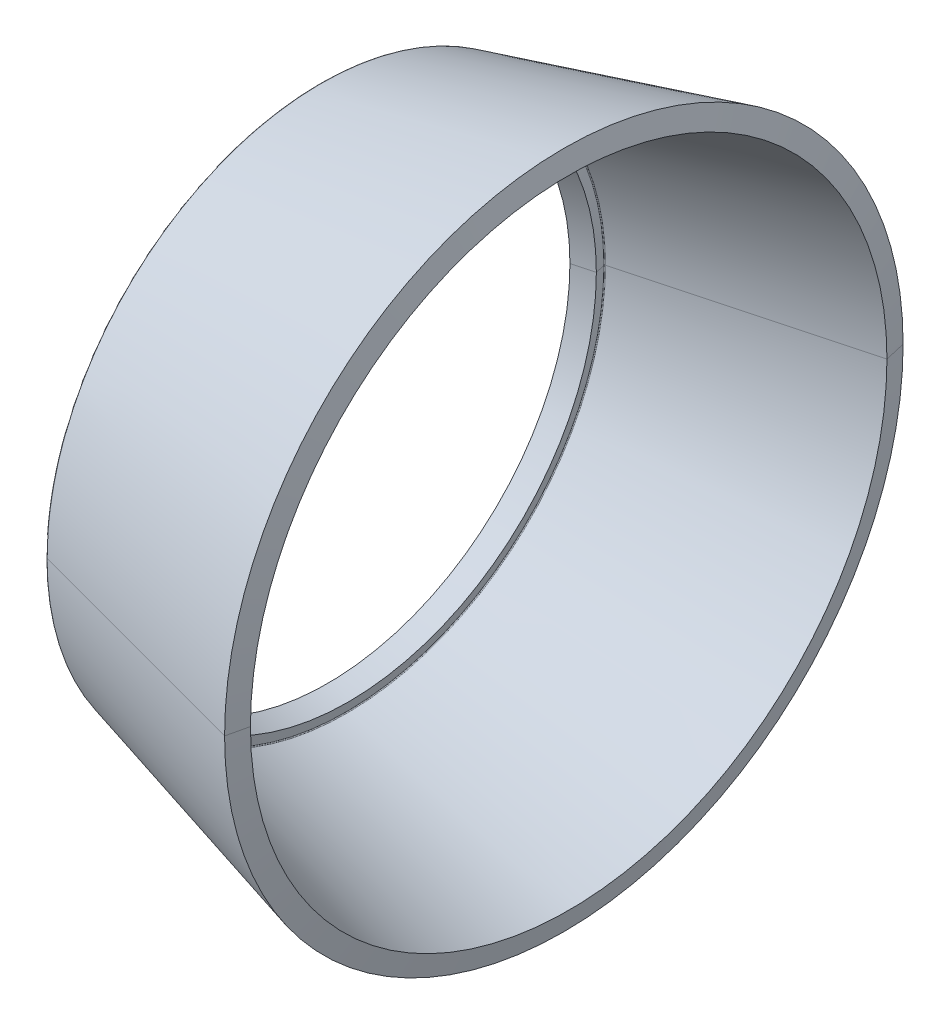
ISO-10303-21;
HEADER;
FILE_DESCRIPTION(('STEP AP214'),'2;1');
FILE_NAME('part.step','',(''),(''),'','','');
FILE_SCHEMA(('AUTOMOTIVE_DESIGN { 1 0 10303 214 1 1 1 1 }'));
ENDSEC;
DATA;
#1=APPLICATION_CONTEXT('core data for automotive mechanical design processes');
#2=APPLICATION_PROTOCOL_DEFINITION('international standard','automotive_design',2000,#1);
#3=PRODUCT_CONTEXT('',#1,'mechanical');
#4=PRODUCT('Part','Part','',(#3));
#5=PRODUCT_RELATED_PRODUCT_CATEGORY('part','',(#4));
#6=PRODUCT_DEFINITION_FORMATION('','',#4);
#7=PRODUCT_DEFINITION_CONTEXT('part definition',#1,'design');
#8=PRODUCT_DEFINITION('design','',#6,#7);
#9=PRODUCT_DEFINITION_SHAPE('','',#8);
#10=(LENGTH_UNIT() NAMED_UNIT(*) SI_UNIT(.MILLI.,.METRE.));
#11=(NAMED_UNIT(*) PLANE_ANGLE_UNIT() SI_UNIT($,.RADIAN.));
#12=(NAMED_UNIT(*) SI_UNIT($,.STERADIAN.) SOLID_ANGLE_UNIT());
#13=UNCERTAINTY_MEASURE_WITH_UNIT(LENGTH_MEASURE(1.E-05),#10,'distance_accuracy_value','');
#14=(GEOMETRIC_REPRESENTATION_CONTEXT(3) GLOBAL_UNCERTAINTY_ASSIGNED_CONTEXT((#13)) GLOBAL_UNIT_ASSIGNED_CONTEXT((#10,
#11,#12)) REPRESENTATION_CONTEXT('',''));
#15=CARTESIAN_POINT('',(0.,0.,0.));
#16=DIRECTION('',(0.,0.,1.));
#17=DIRECTION('',(1.,0.,0.));
#18=AXIS2_PLACEMENT_3D('',#15,#16,#17);
#19=CARTESIAN_POINT('',(10.675889688428,0.,0.));
#20=DIRECTION('',(1.,0.,0.));
#21=DIRECTION('',(0.,1.,0.));
#22=AXIS2_PLACEMENT_3D('',#19,#20,#21);
#23=CONICAL_SURFACE('',#22,15.747207635831,0.261904107554317);
#24=DIRECTION('',(0.965898717525801,0.,0.25892019519924));
#25=VECTOR('',#24,1.);
#26=CARTESIAN_POINT('',(-0.57609560086553,0.,12.730984325228));
#27=LINE('',#26,#25);
#28=CARTESIAN_POINT('',(-0.57609560086553,0.,12.730984325228));
#29=VERTEX_POINT('',#28);
#30=CARTESIAN_POINT('',(10.675889688428,0.,15.747207635831));
#31=VERTEX_POINT('',#30);
#32=EDGE_CURVE('E11',#29,#31,#27,.T.);
#33=ORIENTED_EDGE('',*,*,#32,.F.);
#34=CARTESIAN_POINT('',(-0.57609560086553,0.,0.));
#35=DIRECTION('',(1.,0.,0.));
#36=DIRECTION('',(0.,0.,-1.));
#37=AXIS2_PLACEMENT_3D('',#34,#35,#36);
#38=CIRCLE('',#37,12.730984325228);
#39=CARTESIAN_POINT('',(-0.57609560086553,-12.1078856013595,-3.93409051161652));
#40=VERTEX_POINT('',#39);
#41=EDGE_CURVE('E25',#29,#40,#38,.T.);
#42=ORIENTED_EDGE('',*,*,#41,.T.);
#43=CARTESIAN_POINT('',(-0.57609560086553,0.,0.));
#44=DIRECTION('',(1.,0.,0.));
#45=DIRECTION('',(0.,0.,-1.));
#46=AXIS2_PLACEMENT_3D('',#43,#44,#45);
#47=CIRCLE('',#46,12.730984325228);
#48=CARTESIAN_POINT('',(-0.57609560086553,0.,-12.730984325228));
#49=VERTEX_POINT('',#48);
#50=EDGE_CURVE('E385',#40,#49,#47,.T.);
#51=ORIENTED_EDGE('',*,*,#50,.T.);
#52=DIRECTION('',(0.965898717525801,0.,-0.25892019519924));
#53=VECTOR('',#52,1.);
#54=CARTESIAN_POINT('',(-0.57609560086553,0.,-12.730984325228));
#55=LINE('',#54,#53);
#56=CARTESIAN_POINT('',(10.675889688428,0.,-15.747207635831));
#57=VERTEX_POINT('',#56);
#58=EDGE_CURVE('E125',#49,#57,#55,.T.);
#59=ORIENTED_EDGE('',*,*,#58,.T.);
#60=CARTESIAN_POINT('',(10.675889688428,0.,0.));
#61=DIRECTION('',(1.,0.,0.));
#62=DIRECTION('',(0.,0.,-1.));
#63=AXIS2_PLACEMENT_3D('',#60,#61,#62);
#64=CIRCLE('',#63,15.747207635831);
#65=EDGE_CURVE('E377',#31,#57,#64,.T.);
#66=ORIENTED_EDGE('',*,*,#65,.F.);
#67=EDGE_LOOP('',(#33,#42,#51,#59,#66));
#68=FACE_BOUND('',#67,.T.);
#69=ADVANCED_FACE('F17',(#68),#23,.T.);
#70=CARTESIAN_POINT('',(10.900978684766,0.,0.));
#71=DIRECTION('',(-1.,0.,0.));
#72=DIRECTION('',(0.,1.,0.));
#73=AXIS2_PLACEMENT_3D('',#70,#71,#72);
#74=CONICAL_SURFACE('',#73,14.772240078628,1.34390352403521);
#75=DIRECTION('',(-0.224951054344273,0.,-0.974370064785141));
#76=VECTOR('',#75,1.);
#77=CARTESIAN_POINT('',(10.900978684766,0.,-14.772240078628));
#78=LINE('',#77,#76);
#79=CARTESIAN_POINT('',(10.900978684766,0.,-14.772240078628));
#80=VERTEX_POINT('',#79);
#81=EDGE_CURVE('E372',#80,#57,#78,.T.);
#82=ORIENTED_EDGE('',*,*,#81,.F.);
#83=CARTESIAN_POINT('',(10.900978684766,0.,0.));
#84=DIRECTION('',(1.,0.,0.));
#85=DIRECTION('',(0.,0.,-1.));
#86=AXIS2_PLACEMENT_3D('',#83,#84,#85);
#87=CIRCLE('',#86,14.772240078628);
#88=CARTESIAN_POINT('',(10.900978684766,0.,14.772240078628));
#89=VERTEX_POINT('',#88);
#90=EDGE_CURVE('E367',#89,#80,#87,.T.);
#91=ORIENTED_EDGE('',*,*,#90,.F.);
#92=DIRECTION('',(-0.224951054344273,0.,0.974370064785141));
#93=VECTOR('',#92,1.);
#94=CARTESIAN_POINT('',(10.900978684766,0.,14.772240078628));
#95=LINE('',#94,#93);
#96=EDGE_CURVE('E362',#89,#31,#95,.T.);
#97=ORIENTED_EDGE('',*,*,#96,.T.);
#98=ORIENTED_EDGE('',*,*,#65,.T.);
#99=EDGE_LOOP('',(#82,#91,#97,#98));
#100=FACE_BOUND('',#99,.T.);
#101=ADVANCED_FACE('F426',(#100),#74,.T.);
#102=CARTESIAN_POINT('',(10.900978684766,0.,0.));
#103=DIRECTION('',(-1.,0.,0.));
#104=DIRECTION('',(0.,-1.,0.));
#105=AXIS2_PLACEMENT_3D('',#102,#103,#104);
#106=CONICAL_SURFACE('',#105,14.772240078628,1.34390352403521);
#107=ORIENTED_EDGE('',*,*,#81,.T.);
#108=CARTESIAN_POINT('',(10.675889688428,0.,0.));
#109=DIRECTION('',(1.,0.,0.));
#110=DIRECTION('',(0.,0.,-1.));
#111=AXIS2_PLACEMENT_3D('',#108,#109,#110);
#112=CIRCLE('',#111,15.747207635831);
#113=EDGE_CURVE('E357',#57,#31,#112,.T.);
#114=ORIENTED_EDGE('',*,*,#113,.T.);
#115=ORIENTED_EDGE('',*,*,#96,.F.);
#116=CARTESIAN_POINT('',(10.900978684766,0.,0.));
#117=DIRECTION('',(1.,0.,0.));
#118=DIRECTION('',(0.,0.,-1.));
#119=AXIS2_PLACEMENT_3D('',#116,#117,#118);
#120=CIRCLE('',#119,14.772240078628);
#121=EDGE_CURVE('E352',#80,#89,#120,.T.);
#122=ORIENTED_EDGE('',*,*,#121,.F.);
#123=EDGE_LOOP('',(#107,#114,#115,#122));
#124=FACE_BOUND('',#123,.T.);
#125=ADVANCED_FACE('F430',(#124),#106,.T.);
#126=CARTESIAN_POINT('',(0.596831214381699,0.,0.));
#127=DIRECTION('',(1.,0.,0.));
#128=DIRECTION('',(0.,-1.,0.));
#129=AXIS2_PLACEMENT_3D('',#126,#127,#128);
#130=CONICAL_SURFACE('',#129,12.010095532845,0.261904107554225);
#131=DIRECTION('',(0.965898717525825,0.,0.258920195199152));
#132=VECTOR('',#131,1.);
#133=CARTESIAN_POINT('',(0.596831214381695,0.,12.010095532845));
#134=LINE('',#133,#132);
#135=CARTESIAN_POINT('',(0.596831214381695,0.,12.010095532845));
#136=VERTEX_POINT('',#135);
#137=EDGE_CURVE('E340',#136,#89,#134,.T.);
#138=ORIENTED_EDGE('',*,*,#137,.F.);
#139=CARTESIAN_POINT('',(0.596831214381699,0.,0.));
#140=DIRECTION('',(1.,0.,0.));
#141=DIRECTION('',(0.,0.,-1.));
#142=AXIS2_PLACEMENT_3D('',#139,#140,#141);
#143=CIRCLE('',#142,12.010095532845);
#144=CARTESIAN_POINT('',(0.596831214381698,11.4222796178396,3.71132362371574));
#145=VERTEX_POINT('',#144);
#146=EDGE_CURVE('E337',#145,#136,#143,.T.);
#147=ORIENTED_EDGE('',*,*,#146,.F.);
#148=CARTESIAN_POINT('',(0.596831214381699,0.,0.));
#149=DIRECTION('',(1.,0.,0.));
#150=DIRECTION('',(0.,0.,-1.));
#151=AXIS2_PLACEMENT_3D('',#148,#149,#150);
#152=CIRCLE('',#151,12.010095532845);
#153=CARTESIAN_POINT('',(0.596831214381699,0.,-12.010095532845));
#154=VERTEX_POINT('',#153);
#155=EDGE_CURVE('E330',#154,#145,#152,.T.);
#156=ORIENTED_EDGE('',*,*,#155,.F.);
#157=DIRECTION('',(0.965898717525825,0.,-0.258920195199152));
#158=VECTOR('',#157,1.);
#159=CARTESIAN_POINT('',(0.596831214381699,0.,-12.010095532845));
#160=LINE('',#159,#158);
#161=EDGE_CURVE('E338',#154,#80,#160,.T.);
#162=ORIENTED_EDGE('',*,*,#161,.T.);
#163=ORIENTED_EDGE('',*,*,#121,.T.);
#164=EDGE_LOOP('',(#138,#147,#156,#162,#163));
#165=FACE_BOUND('',#164,.T.);
#166=ADVANCED_FACE('F435',(#165),#130,.F.);
#167=CARTESIAN_POINT('',(0.596831214381699,0.,0.));
#168=DIRECTION('',(1.,0.,0.));
#169=DIRECTION('',(0.,1.,0.));
#170=AXIS2_PLACEMENT_3D('',#167,#168,#169);
#171=CONICAL_SURFACE('',#170,12.010095532845,0.261904107554225);
#172=ORIENTED_EDGE('',*,*,#137,.T.);
#173=ORIENTED_EDGE('',*,*,#90,.T.);
#174=ORIENTED_EDGE('',*,*,#161,.F.);
#175=CARTESIAN_POINT('',(0.596831214381699,0.,0.));
#176=DIRECTION('',(1.,0.,0.));
#177=DIRECTION('',(0.,0.,-1.));
#178=AXIS2_PLACEMENT_3D('',#175,#176,#177);
#179=CIRCLE('',#178,12.010095532845);
#180=CARTESIAN_POINT('',(0.596831214381698,-11.4222796178396,-3.71132362371574));
#181=VERTEX_POINT('',#180);
#182=EDGE_CURVE('E333',#181,#154,#179,.T.);
#183=ORIENTED_EDGE('',*,*,#182,.F.);
#184=CARTESIAN_POINT('',(0.596831214381699,0.,0.));
#185=DIRECTION('',(1.,0.,0.));
#186=DIRECTION('',(0.,0.,-1.));
#187=AXIS2_PLACEMENT_3D('',#184,#185,#186);
#188=CIRCLE('',#187,12.010095532845);
#189=EDGE_CURVE('E447',#136,#181,#188,.T.);
#190=ORIENTED_EDGE('',*,*,#189,.F.);
#191=EDGE_LOOP('',(#172,#173,#174,#183,#190));
#192=FACE_BOUND('',#191,.T.);
#193=ADVANCED_FACE('F301',(#192),#171,.F.);
#194=CARTESIAN_POINT('',(0.607188022189953,0.,0.));
#195=DIRECTION('',(1.,0.,0.));
#196=DIRECTION('',(0.,0.309016994374947,-0.951056516295154));
#197=AXIS2_PLACEMENT_3D('',#194,#195,#196);
#198=TOROIDAL_SURFACE('',#197,11.9714595841438,0.0400000000002776);
#199=CARTESIAN_POINT('',(0.607188022189953,-11.385534647064,-3.69938445897326));
#200=DIRECTION('',(0.,0.30901699437495,-0.951056516295153));
#201=DIRECTION('',(-0.258920195204584,-0.918624269382682,-0.298479118559999));
#202=AXIS2_PLACEMENT_3D('',#199,#200,#201);
#203=CIRCLE('',#202,0.0400000000002771);
#204=CARTESIAN_POINT('',(0.56821321959826,-11.3769770004207,-3.69660391102547));
#205=VERTEX_POINT('',#204);
#206=EDGE_CURVE('E448',#181,#205,#203,.T.);
#207=ORIENTED_EDGE('',*,*,#206,.T.);
#208=CARTESIAN_POINT('',(0.568213219598262,0.,0.));
#209=DIRECTION('',(1.,0.,0.));
#210=DIRECTION('',(0.,0.,1.));
#211=AXIS2_PLACEMENT_3D('',#208,#209,#210);
#212=CIRCLE('',#211,11.96246154197);
#213=CARTESIAN_POINT('',(0.568213219598262,0.,11.96246154197));
#214=VERTEX_POINT('',#213);
#215=EDGE_CURVE('E267',#214,#205,#212,.T.);
#216=ORIENTED_EDGE('',*,*,#215,.F.);
#217=CARTESIAN_POINT('',(0.568213219598262,0.,0.));
#218=DIRECTION('',(1.,0.,0.));
#219=DIRECTION('',(0.,0.951056516295156,0.309016994374939));
#220=AXIS2_PLACEMENT_3D('',#217,#218,#219);
#221=CIRCLE('',#220,11.96246154197);
#222=CARTESIAN_POINT('',(0.56821321959826,11.3769770004207,3.69660391102547));
#223=VERTEX_POINT('',#222);
#224=EDGE_CURVE('E242',#223,#214,#221,.T.);
#225=ORIENTED_EDGE('',*,*,#224,.F.);
#226=CARTESIAN_POINT('',(0.607188022189953,11.385534647064,3.69938445897326));
#227=DIRECTION('',(0.,-0.30901699437495,0.951056516295153));
#228=DIRECTION('',(-0.258920195204584,0.918624269382682,0.298479118559999));
#229=AXIS2_PLACEMENT_3D('',#226,#227,#228);
#230=CIRCLE('',#229,0.0400000000002771);
#231=EDGE_CURVE('E324',#145,#223,#230,.T.);
#232=ORIENTED_EDGE('',*,*,#231,.F.);
#233=ORIENTED_EDGE('',*,*,#146,.T.);
#234=ORIENTED_EDGE('',*,*,#189,.T.);
#235=EDGE_LOOP('',(#207,#216,#225,#232,#233,#234));
#236=FACE_BOUND('',#235,.T.);
#237=ADVANCED_FACE('F296',(#236),#198,.F.);
#238=CARTESIAN_POINT('',(0.607188022189953,0.,0.));
#239=DIRECTION('',(1.,0.,0.));
#240=DIRECTION('',(0.,-0.309016994374947,0.951056516295154));
#241=AXIS2_PLACEMENT_3D('',#238,#239,#240);
#242=TOROIDAL_SURFACE('',#241,11.9714595841438,0.0400000000002776);
#243=ORIENTED_EDGE('',*,*,#206,.F.);
#244=ORIENTED_EDGE('',*,*,#182,.T.);
#245=ORIENTED_EDGE('',*,*,#155,.T.);
#246=ORIENTED_EDGE('',*,*,#231,.T.);
#247=CARTESIAN_POINT('',(0.568213219598261,0.,0.));
#248=DIRECTION('',(1.,0.,0.));
#249=DIRECTION('',(0.,0.,-1.));
#250=AXIS2_PLACEMENT_3D('',#247,#248,#249);
#251=CIRCLE('',#250,11.96246154197);
#252=CARTESIAN_POINT('',(0.568213219598261,0.,-11.96246154197));
#253=VERTEX_POINT('',#252);
#254=EDGE_CURVE('E326',#253,#223,#251,.T.);
#255=ORIENTED_EDGE('',*,*,#254,.F.);
#256=CARTESIAN_POINT('',(0.568213219598262,0.,0.));
#257=DIRECTION('',(1.,0.,0.));
#258=DIRECTION('',(0.,-0.951056516295153,-0.30901699437495));
#259=AXIS2_PLACEMENT_3D('',#256,#257,#258);
#260=CIRCLE('',#259,11.96246154197);
#261=EDGE_CURVE('E256',#205,#253,#260,.T.);
#262=ORIENTED_EDGE('',*,*,#261,.F.);
#263=EDGE_LOOP('',(#243,#244,#245,#246,#255,#262));
#264=FACE_BOUND('',#263,.T.);
#265=ADVANCED_FACE('F287',(#264),#242,.F.);
#266=CARTESIAN_POINT('',(0.672069319895399,0.,0.));
#267=DIRECTION('',(-1.,0.,0.));
#268=DIRECTION('',(0.,1.,0.));
#269=AXIS2_PLACEMENT_3D('',#266,#267,#268);
#270=CONICAL_SURFACE('',#269,11.512611349136,1.34390352403549);
#271=DIRECTION('',(-0.224951054344002,0.,-0.974370064785204));
#272=VECTOR('',#271,1.);
#273=CARTESIAN_POINT('',(0.6720693198954,0.,-11.512611349136));
#274=LINE('',#273,#272);
#275=CARTESIAN_POINT('',(0.672069319895399,0.,-11.512611349136));
#276=VERTEX_POINT('',#275);
#277=EDGE_CURVE('E276',#276,#253,#274,.T.);
#278=ORIENTED_EDGE('',*,*,#277,.F.);
#279=CARTESIAN_POINT('',(0.672069319895399,0.,0.));
#280=DIRECTION('',(1.,0.,0.));
#281=DIRECTION('',(0.,0.,-1.));
#282=AXIS2_PLACEMENT_3D('',#279,#280,#281);
#283=CIRCLE('',#282,11.512611349136);
#284=CARTESIAN_POINT('',(0.6720693198954,0.,11.512611349136));
#285=VERTEX_POINT('',#284);
#286=EDGE_CURVE('E270',#285,#276,#283,.T.);
#287=ORIENTED_EDGE('',*,*,#286,.F.);
#288=DIRECTION('',(-0.224951054344002,0.,0.974370064785204));
#289=VECTOR('',#288,1.);
#290=CARTESIAN_POINT('',(0.6720693198954,0.,11.512611349136));
#291=LINE('',#290,#289);
#292=EDGE_CURVE('E268',#285,#214,#291,.T.);
#293=ORIENTED_EDGE('',*,*,#292,.T.);
#294=ORIENTED_EDGE('',*,*,#215,.T.);
#295=ORIENTED_EDGE('',*,*,#261,.T.);
#296=EDGE_LOOP('',(#278,#287,#293,#294,#295));
#297=FACE_BOUND('',#296,.T.);
#298=ADVANCED_FACE('F222',(#297),#270,.T.);
#299=CARTESIAN_POINT('',(0.672069319895399,0.,0.));
#300=DIRECTION('',(-1.,0.,0.));
#301=DIRECTION('',(0.,-1.,0.));
#302=AXIS2_PLACEMENT_3D('',#299,#300,#301);
#303=CONICAL_SURFACE('',#302,11.512611349136,1.34390352403549);
#304=ORIENTED_EDGE('',*,*,#277,.T.);
#305=ORIENTED_EDGE('',*,*,#254,.T.);
#306=ORIENTED_EDGE('',*,*,#224,.T.);
#307=ORIENTED_EDGE('',*,*,#292,.F.);
#308=CARTESIAN_POINT('',(0.672069319895399,0.,0.));
#309=DIRECTION('',(1.,0.,0.));
#310=DIRECTION('',(0.,0.,-1.));
#311=AXIS2_PLACEMENT_3D('',#308,#309,#310);
#312=CIRCLE('',#311,11.512611349136);
#313=EDGE_CURVE('E271',#276,#285,#312,.T.);
#314=ORIENTED_EDGE('',*,*,#313,.F.);
#315=EDGE_LOOP('',(#304,#305,#306,#307,#314));
#316=FACE_BOUND('',#315,.T.);
#317=ADVANCED_FACE('F217',(#316),#303,.T.);
#318=CARTESIAN_POINT('',(-0.294421695341898,0.,0.));
#319=DIRECTION('',(1.,0.,0.));
#320=DIRECTION('',(0.,-1.,0.));
#321=AXIS2_PLACEMENT_3D('',#318,#319,#320);
#322=CONICAL_SURFACE('',#321,11.253532381763,0.261904107554254);
#323=DIRECTION('',(0.965898717525817,0.,0.25892019519918));
#324=VECTOR('',#323,1.);
#325=CARTESIAN_POINT('',(-0.294421695341898,0.,11.253532381763));
#326=LINE('',#325,#324);
#327=CARTESIAN_POINT('',(-0.294421695341898,0.,11.253532381763));
#328=VERTEX_POINT('',#327);
#329=EDGE_CURVE('E413',#328,#285,#326,.T.);
#330=ORIENTED_EDGE('',*,*,#329,.F.);
#331=CARTESIAN_POINT('',(-0.294421695341898,0.,0.));
#332=DIRECTION('',(1.,0.,0.));
#333=DIRECTION('',(0.,0.,-1.));
#334=AXIS2_PLACEMENT_3D('',#331,#332,#333);
#335=CIRCLE('',#334,11.253532381763);
#336=CARTESIAN_POINT('',(-0.294421695341898,0.,-11.253532381763));
#337=VERTEX_POINT('',#336);
#338=EDGE_CURVE('E408',#337,#328,#335,.T.);
#339=ORIENTED_EDGE('',*,*,#338,.F.);
#340=DIRECTION('',(0.965898717525817,0.,-0.25892019519918));
#341=VECTOR('',#340,1.);
#342=CARTESIAN_POINT('',(-0.294421695341898,0.,-11.253532381763));
#343=LINE('',#342,#341);
#344=EDGE_CURVE('E399',#337,#276,#343,.T.);
#345=ORIENTED_EDGE('',*,*,#344,.T.);
#346=ORIENTED_EDGE('',*,*,#313,.T.);
#347=EDGE_LOOP('',(#330,#339,#345,#346));
#348=FACE_BOUND('',#347,.T.);
#349=ADVANCED_FACE('F213',(#348),#322,.F.);
#350=CARTESIAN_POINT('',(-0.294421695341898,0.,0.));
#351=DIRECTION('',(1.,0.,0.));
#352=DIRECTION('',(0.,1.,0.));
#353=AXIS2_PLACEMENT_3D('',#350,#351,#352);
#354=CONICAL_SURFACE('',#353,11.253532381763,0.261904107554254);
#355=ORIENTED_EDGE('',*,*,#329,.T.);
#356=ORIENTED_EDGE('',*,*,#286,.T.);
#357=ORIENTED_EDGE('',*,*,#344,.F.);
#358=CARTESIAN_POINT('',(-0.294421695341898,0.,0.));
#359=DIRECTION('',(1.,0.,0.));
#360=DIRECTION('',(0.,0.,-1.));
#361=AXIS2_PLACEMENT_3D('',#358,#359,#360);
#362=CIRCLE('',#361,11.253532381763);
#363=EDGE_CURVE('E398',#328,#337,#362,.T.);
#364=ORIENTED_EDGE('',*,*,#363,.F.);
#365=EDGE_LOOP('',(#355,#356,#357,#364));
#366=FACE_BOUND('',#365,.T.);
#367=ADVANCED_FACE('F209',(#366),#354,.F.);
#368=CARTESIAN_POINT('',(-0.61902259304069,0.,0.));
#369=DIRECTION('',(-1.,0.,0.));
#370=DIRECTION('',(0.,1.,0.));
#371=AXIS2_PLACEMENT_3D('',#368,#369,#370);
#372=CONICAL_SURFACE('',#371,12.659533338916,1.34390352403559);
#373=DIRECTION('',(-0.22495105434391,0.,-0.974370064785225));
#374=VECTOR('',#373,1.);
#375=CARTESIAN_POINT('',(-0.294421695341898,0.,-11.253532381763));
#376=LINE('',#375,#374);
#377=CARTESIAN_POINT('',(-0.61902259304069,0.,-12.659533338916));
#378=VERTEX_POINT('',#377);
#379=EDGE_CURVE('E397',#337,#378,#376,.T.);
#380=ORIENTED_EDGE('',*,*,#379,.T.);
#381=CARTESIAN_POINT('',(-0.61902259304069,-12.0399316752318,-3.91201094258126));
#382=CARTESIAN_POINT('',(-0.61902259304069,-11.9887252629866,-4.06961390126869));
#383=CARTESIAN_POINT('',(-0.61902259304069,-11.9344210102385,-4.22621018172286));
#384=CARTESIAN_POINT('',(-0.61902259304069,-11.8197079805472,-4.53715066475716));
#385=CARTESIAN_POINT('',(-0.61902259304069,-11.759299203604,-4.69149486733729));
#386=CARTESIAN_POINT('',(-0.61902259304069,-11.6324682823335,-4.99769247321601));
#387=CARTESIAN_POINT('',(-0.61902259304069,-11.5660461380061,-5.1495458765146));
#388=CARTESIAN_POINT('',(-0.61902259304069,-11.4272914330891,-5.45052793351918));
#389=CARTESIAN_POINT('',(-0.61902259304069,-11.3549588724994,-5.59965658722517));
#390=CARTESIAN_POINT('',(-0.61902259304069,-11.2044947238092,-5.89495914678267));
#391=CARTESIAN_POINT('',(-0.61902259304069,-11.1263631357087,-6.04113305263419));
#392=CARTESIAN_POINT('',(-0.61902259304069,-10.9644214435096,-6.33030074103225));
#393=CARTESIAN_POINT('',(-0.61902259304069,-10.880611339411,-6.47329452357878));
#394=CARTESIAN_POINT('',(-0.61902259304069,-10.7074418340679,-6.75588147553583));
#395=CARTESIAN_POINT('',(-0.61902259304069,-10.6180824328234,-6.89547464494634));
#396=CARTESIAN_POINT('',(-0.61902259304069,-10.4339521216559,-7.17104512909561));
#397=CARTESIAN_POINT('',(-0.61902259304069,-10.3391812117328,-7.30702244383437));
#398=CARTESIAN_POINT('',(-0.61902259304069,-10.1443740123458,-7.57515155120504));
#399=CARTESIAN_POINT('',(-0.61902259304069,-10.0443377228819,-7.70730334383696));
#400=CARTESIAN_POINT('',(-0.61902259304069,-9.8391540133181,-7.96757763858104));
#401=CARTESIAN_POINT('',(-0.61902259304069,-9.73400659321823,-8.09570014069321));
#402=CARTESIAN_POINT('',(-0.61902259304069,-9.5187627520302,-8.34771829876654));
#403=CARTESIAN_POINT('',(-0.61902259304069,-9.40866633094205,-8.4716139547277));
#404=CARTESIAN_POINT('',(-0.61902259304069,-9.18369424849301,-8.71498738238289));
#405=CARTESIAN_POINT('',(-0.61902259304069,-9.06881858713212,-8.83446515407692));
#406=CARTESIAN_POINT('',(-0.61902259304069,-8.83446515407726,-9.06881858713241));
#407=CARTESIAN_POINT('',(-0.61902259304069,-8.7149873823833,-9.18369424849387));
#408=CARTESIAN_POINT('',(-0.61902259304069,-8.47161395472735,-9.40866633094114));
#409=CARTESIAN_POINT('',(-0.61902259304069,-8.34771829876536,-9.51876275202695));
#410=CARTESIAN_POINT('',(-0.61902259304069,-8.09570014069445,-9.73400659322144));
#411=CARTESIAN_POINT('',(-0.61902259304069,-7.96757763858552,-9.83915401333012));
#412=CARTESIAN_POINT('',(-0.61902259304069,-7.70730334383255,-10.0443377228698));
#413=CARTESIAN_POINT('',(-0.61902259304069,-7.5751515511885,-10.1443740123008));
#414=CARTESIAN_POINT('',(-0.61902259304069,-7.30702244385097,-10.3391812117777));
#415=CARTESIAN_POINT('',(-0.61902259304069,-7.17104512915749,-10.4339521218235));
#416=CARTESIAN_POINT('',(-0.61902259304069,-6.89547464488453,-10.6180824326558));
#417=CARTESIAN_POINT('',(-0.61902259304069,-6.75588147530504,-10.7074418334422));
#418=CARTESIAN_POINT('',(-0.61902259304069,-6.47329452380964,-10.8806113400366));
#419=CARTESIAN_POINT('',(-0.61902259304069,-6.33030074189372,-10.9644214458446));
#420=CARTESIAN_POINT('',(-0.61902259304069,-6.04113305177279,-11.1263631333737));
#421=CARTESIAN_POINT('',(-0.61902259304069,-5.89495914356777,-11.2044947150949));
#422=CARTESIAN_POINT('',(-0.61902259304069,-5.59965659044014,-11.3549588812136));
#423=CARTESIAN_POINT('',(-0.61902259304069,-5.45052794551754,-11.4272914656111));
#424=CARTESIAN_POINT('',(-0.61902259304069,-5.14954586451631,-11.566046105484));
#425=CARTESIAN_POINT('',(-0.61902259304069,-4.99769242843768,-11.6324681609595));
#426=CARTESIAN_POINT('',(-0.61902259304069,-4.6914949121157,-11.759299324978));
#427=CARTESIAN_POINT('',(-0.61902259304069,-4.53715083187234,-11.8197084335211));
#428=CARTESIAN_POINT('',(-0.61902259304069,-4.22621001460776,-11.9344205572645));
#429=CARTESIAN_POINT('',(-0.61902259304069,-4.06961327758653,-11.9887235724648));
#430=CARTESIAN_POINT('',(-0.61902259304069,-3.75440860757607,-12.0911397779988));
#431=CARTESIAN_POINT('',(-0.61902259304069,-3.59580067458685,-12.1392529683327));
#432=CARTESIAN_POINT('',(-0.61902259304069,-3.27681817460775,-12.2292153378658));
#433=CARTESIAN_POINT('',(-0.61902259304069,-3.11644360761788,-12.2710645170651));
#434=CARTESIAN_POINT('',(-0.61902259304069,-2.79417512548062,-12.3484343330019));
#435=CARTESIAN_POINT('',(-0.61902259304069,-2.63228121033324,-12.3839549697394));
#436=CARTESIAN_POINT('',(-0.61902259304069,-2.3072236609929,-12.4486129414261));
#437=CARTESIAN_POINT('',(-0.61902259304069,-2.14406002679995,-12.4777502763753));
#438=CARTESIAN_POINT('',(-0.61902259304069,-1.81671462426472,-12.5295966760702));
#439=CARTESIAN_POINT('',(-0.61902259304069,-1.65253285592244,-12.5523057408159));
#440=CARTESIAN_POINT('',(-0.61902259304069,-1.32340434745147,-12.5912607364776));
#441=CARTESIAN_POINT('',(-0.61902259304069,-1.15845760732278,-12.6075066673935));
#442=CARTESIAN_POINT('',(-0.61902259304069,-0.82805346889302,-12.6335097776821));
#443=CARTESIAN_POINT('',(-0.61902259304069,-0.662596070591964,-12.6432669570548));
#444=CARTESIAN_POINT('',(-0.61902259304069,-0.331425822371384,-12.6562796379499));
#445=CARTESIAN_POINT('',(-0.61902259304069,-0.16571297245186,-12.6595351394723));
#446=CARTESIAN_POINT('',(-0.61902259304069,0.,-12.659533338916));
#447=B_SPLINE_CURVE_WITH_KNOTS('',3,(#381,#382,#383,#384,#385,#386,#387,#388,#389,#390,#391,
#392,#393,#394,#395,#396,#397,#398,#399,#400,#401,#402,#403,#404,#405,#406,#407,#408,#409,#410,
#411,#412,#413,#414,#415,#416,#417,#418,#419,#420,#421,#422,#423,#424,#425,#426,#427,#428,#429,
#430,#431,#432,#433,#434,#435,#436,#437,#438,#439,#440,#441,#442,#443,#444,#445,#446),
.UNSPECIFIED.,.F.,.F.,(4,2,2,2,2,2,2,2,2,2,2,2,2,2,2,2,2,2,2,2,2,2,2,2,2,2,2,2,2,2,2,2,4),(0.,
0.497106768542692,0.994213537085385,1.49132030562808,1.98842707417078,2.48553384271347,
2.98264061125617,3.47974737979886,3.97685414834155,4.47396091688424,4.97106768542694,
5.46817445396963,5.96528122251233,6.46238799105502,6.95949475959772,7.45660152814041,
7.9537082966831,8.45081506522579,8.94792183376849,9.44502860231119,9.94213537085388,
10.4392421393966,10.9363489079393,11.433455676482,11.9305624450247,12.4276692135674,
12.92477598211,13.4218827506527,13.9189895191954,14.4160962877381,14.9132030562808,
15.4103098248235,15.9074165933662),.UNSPECIFIED.);
#448=CARTESIAN_POINT('',(-0.61902259304069,-12.0399316752318,-3.91201094258126));
#449=VERTEX_POINT('',#448);
#450=EDGE_CURVE('E161',#449,#378,#447,.T.);
#451=ORIENTED_EDGE('',*,*,#450,.F.);
#452=CARTESIAN_POINT('',(-0.61902259304069,0.,0.));
#453=DIRECTION('',(1.,0.,0.));
#454=DIRECTION('',(0.,0.,-1.));
#455=AXIS2_PLACEMENT_3D('',#452,#453,#454);
#456=CIRCLE('',#455,12.659533338916);
#457=CARTESIAN_POINT('',(-0.61902259304069,0.,12.659533338916));
#458=VERTEX_POINT('',#457);
#459=EDGE_CURVE('E189',#458,#449,#456,.T.);
#460=ORIENTED_EDGE('',*,*,#459,.F.);
#461=DIRECTION('',(-0.22495105434391,0.,0.974370064785225));
#462=VECTOR('',#461,1.);
#463=CARTESIAN_POINT('',(-0.294421695341898,0.,11.253532381763));
#464=LINE('',#463,#462);
#465=EDGE_CURVE('E187',#328,#458,#464,.T.);
#466=ORIENTED_EDGE('',*,*,#465,.F.);
#467=ORIENTED_EDGE('',*,*,#363,.T.);
#468=EDGE_LOOP('',(#380,#451,#460,#466,#467));
#469=FACE_BOUND('',#468,.T.);
#470=ADVANCED_FACE('F200',(#469),#372,.F.);
#471=CARTESIAN_POINT('',(-0.61902259304069,0.,0.));
#472=DIRECTION('',(-1.,0.,0.));
#473=DIRECTION('',(0.,-1.,0.));
#474=AXIS2_PLACEMENT_3D('',#471,#472,#473);
#475=CONICAL_SURFACE('',#474,12.659533338916,1.34390352403559);
#476=ORIENTED_EDGE('',*,*,#379,.F.);
#477=ORIENTED_EDGE('',*,*,#338,.T.);
#478=ORIENTED_EDGE('',*,*,#465,.T.);
#479=CARTESIAN_POINT('',(-0.61902259304069,12.0399316752318,3.91201094258126));
#480=CARTESIAN_POINT('',(-0.61902259304069,11.9887252629866,4.06961390126869));
#481=CARTESIAN_POINT('',(-0.61902259304069,11.9344210102385,4.22621018172286));
#482=CARTESIAN_POINT('',(-0.61902259304069,11.8197079805472,4.53715066475716));
#483=CARTESIAN_POINT('',(-0.61902259304069,11.759299203604,4.6914948673373));
#484=CARTESIAN_POINT('',(-0.61902259304069,11.6324682823335,4.99769247321602));
#485=CARTESIAN_POINT('',(-0.61902259304069,11.5660461380061,5.1495458765146));
#486=CARTESIAN_POINT('',(-0.61902259304069,11.4272914330891,5.45052793351918));
#487=CARTESIAN_POINT('',(-0.61902259304069,11.3549588724994,5.59965658722517));
#488=CARTESIAN_POINT('',(-0.61902259304069,11.2044947238092,5.89495914678268));
#489=CARTESIAN_POINT('',(-0.61902259304069,11.1263631357087,6.0411330526342));
#490=CARTESIAN_POINT('',(-0.61902259304069,10.9644214435096,6.33030074103225));
#491=CARTESIAN_POINT('',(-0.61902259304069,10.880611339411,6.47329452357879));
#492=CARTESIAN_POINT('',(-0.61902259304069,10.7074418340679,6.75588147553584));
#493=CARTESIAN_POINT('',(-0.61902259304069,10.6180824328234,6.89547464494635));
#494=CARTESIAN_POINT('',(-0.61902259304069,10.4339521216558,7.17104512909562));
#495=CARTESIAN_POINT('',(-0.61902259304069,10.3391812117328,7.30702244383437));
#496=CARTESIAN_POINT('',(-0.61902259304069,10.1443740123458,7.57515155120505));
#497=CARTESIAN_POINT('',(-0.61902259304069,10.0443377228819,7.70730334383697));
#498=CARTESIAN_POINT('',(-0.61902259304069,9.8391540133181,7.96757763858105));
#499=CARTESIAN_POINT('',(-0.61902259304069,9.73400659321822,8.09570014069322));
#500=CARTESIAN_POINT('',(-0.61902259304069,9.5187627520302,8.34771829876655));
#501=CARTESIAN_POINT('',(-0.61902259304069,9.40866633094204,8.47161395472771));
#502=CARTESIAN_POINT('',(-0.61902259304069,9.183694248493,8.7149873823829));
#503=CARTESIAN_POINT('',(-0.61902259304069,9.06881858713211,8.83446515407693));
#504=CARTESIAN_POINT('',(-0.61902259304069,8.83446515407726,9.06881858713242));
#505=CARTESIAN_POINT('',(-0.61902259304069,8.71498738238329,9.18369424849388));
#506=CARTESIAN_POINT('',(-0.61902259304069,8.47161395472734,9.40866633094115));
#507=CARTESIAN_POINT('',(-0.61902259304069,8.34771829876535,9.51876275202696));
#508=CARTESIAN_POINT('',(-0.61902259304069,8.09570014069444,9.73400659322145));
#509=CARTESIAN_POINT('',(-0.61902259304069,7.96757763858551,9.83915401333013));
#510=CARTESIAN_POINT('',(-0.61902259304069,7.70730334383253,10.0443377228698));
#511=CARTESIAN_POINT('',(-0.61902259304069,7.57515155118849,10.1443740123008));
#512=CARTESIAN_POINT('',(-0.61902259304069,7.30702244385096,10.3391812117777));
#513=CARTESIAN_POINT('',(-0.61902259304069,7.17104512915748,10.4339521218235));
#514=CARTESIAN_POINT('',(-0.61902259304069,6.89547464488451,10.6180824326558));
#515=CARTESIAN_POINT('',(-0.61902259304069,6.75588147530502,10.7074418334422));
#516=CARTESIAN_POINT('',(-0.61902259304069,6.47329452380962,10.8806113400366));
#517=CARTESIAN_POINT('',(-0.61902259304069,6.3303007418937,10.9644214458446));
#518=CARTESIAN_POINT('',(-0.61902259304069,6.04113305177277,11.1263631333737));
#519=CARTESIAN_POINT('',(-0.61902259304069,5.89495914356775,11.204494715095));
#520=CARTESIAN_POINT('',(-0.61902259304069,5.59965659044013,11.3549588812137));
#521=CARTESIAN_POINT('',(-0.61902259304069,5.45052794551752,11.4272914656111));
#522=CARTESIAN_POINT('',(-0.61902259304069,5.14954586451629,11.5660461054841));
#523=CARTESIAN_POINT('',(-0.61902259304069,4.99769242843766,11.6324681609595));
#524=CARTESIAN_POINT('',(-0.61902259304069,4.69149491211568,11.759299324978));
#525=CARTESIAN_POINT('',(-0.61902259304069,4.53715083187232,11.8197084335211));
#526=CARTESIAN_POINT('',(-0.61902259304069,4.22621001460773,11.9344205572645));
#527=CARTESIAN_POINT('',(-0.61902259304069,4.0696132775865,11.9887235724648));
#528=CARTESIAN_POINT('',(-0.61902259304069,3.75440860757605,12.0911397779988));
#529=CARTESIAN_POINT('',(-0.61902259304069,3.59580067458682,12.1392529683327));
#530=CARTESIAN_POINT('',(-0.61902259304069,3.27681817460772,12.2292153378658));
#531=CARTESIAN_POINT('',(-0.61902259304069,3.11644360761785,12.2710645170651));
#532=CARTESIAN_POINT('',(-0.61902259304069,2.7941751254806,12.3484343330019));
#533=CARTESIAN_POINT('',(-0.61902259304069,2.63228121033322,12.3839549697394));
#534=CARTESIAN_POINT('',(-0.61902259304069,2.30722366099288,12.4486129414261));
#535=CARTESIAN_POINT('',(-0.61902259304069,2.14406002679992,12.4777502763753));
#536=CARTESIAN_POINT('',(-0.61902259304069,1.81671462426469,12.5295966760702));
#537=CARTESIAN_POINT('',(-0.61902259304069,1.65253285592241,12.5523057408159));
#538=CARTESIAN_POINT('',(-0.61902259304069,1.32340434745144,12.5912607364776));
#539=CARTESIAN_POINT('',(-0.61902259304069,1.15845760732274,12.6075066673935));
#540=CARTESIAN_POINT('',(-0.61902259304069,0.828053468892991,12.6335097776821));
#541=CARTESIAN_POINT('',(-0.61902259304069,0.662596070591935,12.6432669570548));
#542=CARTESIAN_POINT('',(-0.61902259304069,0.331425822371353,12.6562796379499));
#543=CARTESIAN_POINT('',(-0.61902259304069,0.165712972451827,12.6595351394723));
#544=CARTESIAN_POINT('',(-0.61902259304069,0.,12.659533338916));
#545=B_SPLINE_CURVE_WITH_KNOTS('',3,(#479,#480,#481,#482,#483,#484,#485,#486,#487,#488,#489,
#490,#491,#492,#493,#494,#495,#496,#497,#498,#499,#500,#501,#502,#503,#504,#505,#506,#507,#508,
#509,#510,#511,#512,#513,#514,#515,#516,#517,#518,#519,#520,#521,#522,#523,#524,#525,#526,#527,
#528,#529,#530,#531,#532,#533,#534,#535,#536,#537,#538,#539,#540,#541,#542,#543,#544),
.UNSPECIFIED.,.F.,.F.,(4,2,2,2,2,2,2,2,2,2,2,2,2,2,2,2,2,2,2,2,2,2,2,2,2,2,2,2,2,2,2,2,4),(0.,
0.497106768542695,0.994213537085388,1.49132030562809,1.98842707417078,2.48553384271347,
2.98264061125617,3.47974737979886,3.97685414834156,4.47396091688425,4.97106768542695,
5.46817445396965,5.96528122251234,6.46238799105503,6.95949475959773,7.45660152814043,
7.95370829668312,8.45081506522581,8.94792183376851,9.44502860231121,9.94213537085389,
10.4392421393966,10.9363489079393,11.433455676482,11.9305624450247,12.4276692135674,
12.9247759821101,13.4218827506528,13.9189895191955,14.4160962877382,14.9132030562808,
15.4103098248235,15.9074165933662),.UNSPECIFIED.);
#546=CARTESIAN_POINT('',(-0.61902259304069,12.0399316752318,3.91201094258126));
#547=VERTEX_POINT('',#546);
#548=EDGE_CURVE('E186',#547,#458,#545,.T.);
#549=ORIENTED_EDGE('',*,*,#548,.F.);
#550=CARTESIAN_POINT('',(-0.61902259304069,0.,-12.659533338916));
#551=CARTESIAN_POINT('',(-0.61902259304069,0.248569876253784,-12.6595424454434));
#552=CARTESIAN_POINT('',(-0.61902259304069,0.497138822326978,-12.652212690076));
#553=CARTESIAN_POINT('',(-0.61902259304069,0.993414980695001,-12.6229408563775));
#554=CARTESIAN_POINT('',(-0.61902259304069,1.24112219298983,-12.6009987780465));
#555=CARTESIAN_POINT('',(-0.61902259304069,1.73481501038397,-12.542567699247));
#556=CARTESIAN_POINT('',(-0.61902259304069,1.98080061548328,-12.5060786987785));
#557=CARTESIAN_POINT('',(-0.61902259304069,2.47019711788943,-12.4186832181188));
#558=CARTESIAN_POINT('',(-0.61902259304069,2.71360801519627,-12.3677767379276));
#559=CARTESIAN_POINT('',(-0.61902259304069,3.19701071790212,-12.2517221121394));
#560=CARTESIAN_POINT('',(-0.61902259304069,3.43700252330113,-12.1865739665425));
#561=CARTESIAN_POINT('',(-0.61902259304069,3.91273457565751,-12.0422622005682));
#562=CARTESIAN_POINT('',(-0.61902259304069,4.1484748226149,-11.9630985801909));
#563=CARTESIAN_POINT('',(-0.61902259304069,4.61488602386509,-11.7910304105948));
#564=CARTESIAN_POINT('',(-0.61902259304069,4.84555697815791,-11.6981258613759));
#565=CARTESIAN_POINT('',(-0.61902259304069,5.30102944824385,-11.4988981142995));
#566=CARTESIAN_POINT('',(-0.61902259304069,5.52583096403698,-11.3925749164419));
#567=CARTESIAN_POINT('',(-0.61902259304069,5.96878476997085,-11.1668786798667));
#568=CARTESIAN_POINT('',(-0.61902259304069,6.1869370601116,-11.0475056411491));
#569=CARTESIAN_POINT('',(-0.61902259304069,6.61583569258295,-10.7961238026811));
#570=CARTESIAN_POINT('',(-0.61902259304069,6.82658203491357,-10.6641150029308));
#571=CARTESIAN_POINT('',(-0.61902259304069,7.23993773912837,-10.3879195515485));
#572=CARTESIAN_POINT('',(-0.61902259304069,7.44254710101257,-10.2437328999165));
#573=CARTESIAN_POINT('',(-0.61902259304069,7.83892603711157,-9.9436818965673));
#574=CARTESIAN_POINT('',(-0.61902259304069,8.03269561132639,-9.78781754485008));
#575=CARTESIAN_POINT('',(-0.61902259304069,8.41072282813336,-9.46495180039836));
#576=CARTESIAN_POINT('',(-0.61902259304069,8.59498047072552,-9.29795040766385));
#577=CARTESIAN_POINT('',(-0.61902259304069,8.95334467513012,-8.95338987221241));
#578=CARTESIAN_POINT('',(-0.61902259304069,9.12745123694256,-8.77583072949547));
#579=CARTESIAN_POINT('',(-0.61902259304069,9.46490934249245,-8.41077060761519));
#580=CARTESIAN_POINT('',(-0.61902259304069,9.62826088622991,-8.22326962845184));
#581=CARTESIAN_POINT('',(-0.61902259304069,9.94364232512234,-7.83897623325636));
#582=CARTESIAN_POINT('',(-0.61902259304069,10.0956722202773,-7.64218381722422));
#583=CARTESIAN_POINT('',(-0.61902259304069,10.3878830038012,-7.23999017781525));
#584=CARTESIAN_POINT('',(-0.61902259304069,10.5280638921701,-7.03458895443841));
#585=CARTESIAN_POINT('',(-0.61902259304069,10.7960904055118,-6.61589019191977));
#586=CARTESIAN_POINT('',(-0.61902259304069,10.9239360304845,-6.40259265277797));
#587=CARTESIAN_POINT('',(-0.61902259304069,11.1668485487338,-5.96884114088853));
#588=CARTESIAN_POINT('',(-0.61902259304069,11.2819154420103,-5.74838716814089));
#589=CARTESIAN_POINT('',(-0.61902259304069,11.4988713551728,-5.30108749528954));
#590=CARTESIAN_POINT('',(-0.61902259304069,11.6007603750589,-5.07424179518584));
#591=CARTESIAN_POINT('',(-0.61902259304069,11.7910071108786,-4.61494554536754));
#592=CARTESIAN_POINT('',(-0.61902259304069,11.8793648268122,-4.38249499565295));
#593=CARTESIAN_POINT('',(-0.61902259304069,12.0422424613015,-3.91279536633969));
#594=CARTESIAN_POINT('',(-0.61902259304069,12.1167623798572,-3.67554628674102));
#595=CARTESIAN_POINT('',(-0.61902259304069,12.2517059263412,-3.19707256245356));
#596=CARTESIAN_POINT('',(-0.61902259304069,12.3121295542696,-2.95584791776478));
#597=CARTESIAN_POINT('',(-0.61902259304069,12.4186709235249,-2.470259818359));
#598=CARTESIAN_POINT('',(-0.61902259304069,12.464788664852,-2.22589636364201));
#599=CARTESIAN_POINT('',(-0.61902259304069,12.5425582875935,-1.73487828742265));
#600=CARTESIAN_POINT('',(-0.61902259304069,12.574210169008,-1.48822366592028));
#601=CARTESIAN_POINT('',(-0.61902259304069,12.6229382823653,-0.993478845654353));
#602=CARTESIAN_POINT('',(-0.61902259304069,12.6400145143082,-0.745388646890794));
#603=CARTESIAN_POINT('',(-0.61902259304069,12.6595320806965,-0.248633246072542));
#604=CARTESIAN_POINT('',(-0.61902259304069,12.6619734151419,3.1955982150863E-05));
#605=CARTESIAN_POINT('',(-0.61902259304069,12.6522127716027,0.49707481256047));
#606=CARTESIAN_POINT('',(-0.61902259304069,12.6400107936182,0.745452467084097));
#607=CARTESIAN_POINT('',(-0.61902259304069,12.6010056514573,1.24105860913154));
#608=CARTESIAN_POINT('',(-0.61902259304069,12.574202487281,1.48828709665536));
#609=CARTESIAN_POINT('',(-0.61902259304069,12.506088692426,1.98073751807621));
#610=CARTESIAN_POINT('',(-0.61902259304069,12.4647780617474,2.22595945197324));
#611=CARTESIAN_POINT('',(-0.61902259304069,12.3677898494182,2.71354541935276));
#612=CARTESIAN_POINT('',(-0.61902259304069,12.3121122677676,2.95590945283525));
#613=CARTESIAN_POINT('',(-0.61902259304069,12.1865936691116,3.43694162120242));
#614=CARTESIAN_POINT('',(-0.61902259304069,12.1167526521061,3.6756097560871));
#615=CARTESIAN_POINT('',(-0.61902259304069,12.0399316752318,3.91201094258123));
#616=B_SPLINE_CURVE_WITH_KNOTS('',3,(#550,#551,#552,#553,#554,#555,#556,#557,#558,#559,#560,
#561,#562,#563,#564,#565,#566,#567,#568,#569,#570,#571,#572,#573,#574,#575,#576,#577,#578,#579,
#580,#581,#582,#583,#584,#585,#586,#587,#588,#589,#590,#591,#592,#593,#594,#595,#596,#597,#598,
#599,#600,#601,#602,#603,#604,#605,#606,#607,#608,#609,#610,#611,#612,#613,#614,#615),
.UNSPECIFIED.,.F.,.F.,(4,2,2,2,2,2,2,2,2,2,2,2,2,2,2,2,2,2,2,2,2,2,2,2,2,2,2,2,2,2,2,2,4),(0.,
0.745600262005527,1.49120052401105,2.23680078601659,2.98240104802211,3.72800131002764,
4.47360157203316,5.21920183403869,5.96480209604422,6.71040235804974,7.45600262005528,
8.2016028820608,8.94720314406632,9.69280340607185,10.4384036680774,11.1840039300829,
11.9296041920884,12.675204454094,13.4208047160995,14.166404978105,14.9120052401105,
15.6576055021161,16.4032057641216,17.1488060261271,17.8944062881326,18.6400065501382,
19.3856068121437,20.1312070741492,20.8768073361548,21.6224075981603,22.3680078601658,
23.1136081221713,23.8592083841769),.UNSPECIFIED.);
#617=EDGE_CURVE('E113',#378,#547,#616,.T.);
#618=ORIENTED_EDGE('',*,*,#617,.F.);
#619=EDGE_LOOP('',(#476,#477,#478,#549,#618));
#620=FACE_BOUND('',#619,.T.);
#621=ADVANCED_FACE('F147',(#620),#475,.F.);
#622=CARTESIAN_POINT('',(-0.560560389154867,0.,0.));
#623=DIRECTION('',(1.,0.,0.));
#624=DIRECTION('',(0.,-0.309016994374947,0.951056516295154));
#625=AXIS2_PLACEMENT_3D('',#622,#623,#624);
#626=TOROIDAL_SURFACE('',#625,12.6730304021773,0.059999999998883);
#627=CARTESIAN_POINT('',(-0.560560389154867,-12.0527681451973,-3.91618176450315));
#628=DIRECTION('',(0.,0.30901699437494,-0.951056516295156));
#629=DIRECTION('',(-0.258920195182528,-0.918624269388308,-0.298479118561816));
#630=AXIS2_PLACEMENT_3D('',#627,#628,#629);
#631=CIRCLE('',#630,0.0599999999988841);
#632=EDGE_CURVE('E117',#40,#449,#631,.T.);
#633=ORIENTED_EDGE('',*,*,#632,.T.);
#634=ORIENTED_EDGE('',*,*,#450,.T.);
#635=ORIENTED_EDGE('',*,*,#617,.T.);
#636=CARTESIAN_POINT('',(-0.560560389154867,12.0527681451973,3.91618176450315));
#637=DIRECTION('',(0.,-0.30901699437494,0.951056516295156));
#638=DIRECTION('',(-0.258920195182526,0.918624269388309,0.298479118561816));
#639=AXIS2_PLACEMENT_3D('',#636,#637,#638);
#640=CIRCLE('',#639,0.059999999998884);
#641=CARTESIAN_POINT('',(-0.57609560086553,12.1078856013595,3.93409051161652));
#642=VERTEX_POINT('',#641);
#643=EDGE_CURVE('E103',#642,#547,#640,.T.);
#644=ORIENTED_EDGE('',*,*,#643,.F.);
#645=CARTESIAN_POINT('',(-0.57609560086553,0.,0.));
#646=DIRECTION('',(1.,0.,0.));
#647=DIRECTION('',(0.,0.,-1.));
#648=AXIS2_PLACEMENT_3D('',#645,#646,#647);
#649=CIRCLE('',#648,12.730984325228);
#650=EDGE_CURVE('E109',#49,#642,#649,.T.);
#651=ORIENTED_EDGE('',*,*,#650,.F.);
#652=ORIENTED_EDGE('',*,*,#50,.F.);
#653=EDGE_LOOP('',(#633,#634,#635,#644,#651,#652));
#654=FACE_BOUND('',#653,.T.);
#655=ADVANCED_FACE('F106',(#654),#626,.T.);
#656=CARTESIAN_POINT('',(10.675889688428,0.,0.));
#657=DIRECTION('',(1.,0.,0.));
#658=DIRECTION('',(0.,-1.,0.));
#659=AXIS2_PLACEMENT_3D('',#656,#657,#658);
#660=CONICAL_SURFACE('',#659,15.747207635831,0.261904107554317);
#661=ORIENTED_EDGE('',*,*,#32,.T.);
#662=ORIENTED_EDGE('',*,*,#113,.F.);
#663=ORIENTED_EDGE('',*,*,#58,.F.);
#664=ORIENTED_EDGE('',*,*,#650,.T.);
#665=CARTESIAN_POINT('',(-0.57609560086553,0.,0.));
#666=DIRECTION('',(1.,0.,0.));
#667=DIRECTION('',(0.,0.,-1.));
#668=AXIS2_PLACEMENT_3D('',#665,#666,#667);
#669=CIRCLE('',#668,12.730984325228);
#670=EDGE_CURVE('E119',#642,#29,#669,.T.);
#671=ORIENTED_EDGE('',*,*,#670,.T.);
#672=EDGE_LOOP('',(#661,#662,#663,#664,#671));
#673=FACE_BOUND('',#672,.T.);
#674=ADVANCED_FACE('F123',(#673),#660,.T.);
#675=CARTESIAN_POINT('',(-0.560560389154867,0.,0.));
#676=DIRECTION('',(1.,0.,0.));
#677=DIRECTION('',(0.,0.309016994374947,-0.951056516295154));
#678=AXIS2_PLACEMENT_3D('',#675,#676,#677);
#679=TOROIDAL_SURFACE('',#678,12.6730304021773,0.059999999998883);
#680=ORIENTED_EDGE('',*,*,#632,.F.);
#681=ORIENTED_EDGE('',*,*,#41,.F.);
#682=ORIENTED_EDGE('',*,*,#670,.F.);
#683=ORIENTED_EDGE('',*,*,#643,.T.);
#684=ORIENTED_EDGE('',*,*,#548,.T.);
#685=ORIENTED_EDGE('',*,*,#459,.T.);
#686=EDGE_LOOP('',(#680,#681,#682,#683,#684,#685));
#687=FACE_BOUND('',#686,.T.);
#688=ADVANCED_FACE('F120',(#687),#679,.T.);
#689=CLOSED_SHELL('',(#69,#101,#125,#166,#193,#237,#265,#298,#317,#349,#367,#470,#621,#655,#674,#688));
#690=MANIFOLD_SOLID_BREP('B1',#689);
#691=ADVANCED_BREP_SHAPE_REPRESENTATION('',(#18,#690),#14);
#692=SHAPE_DEFINITION_REPRESENTATION(#9,#691);
ENDSEC;
END-ISO-10303-21;
